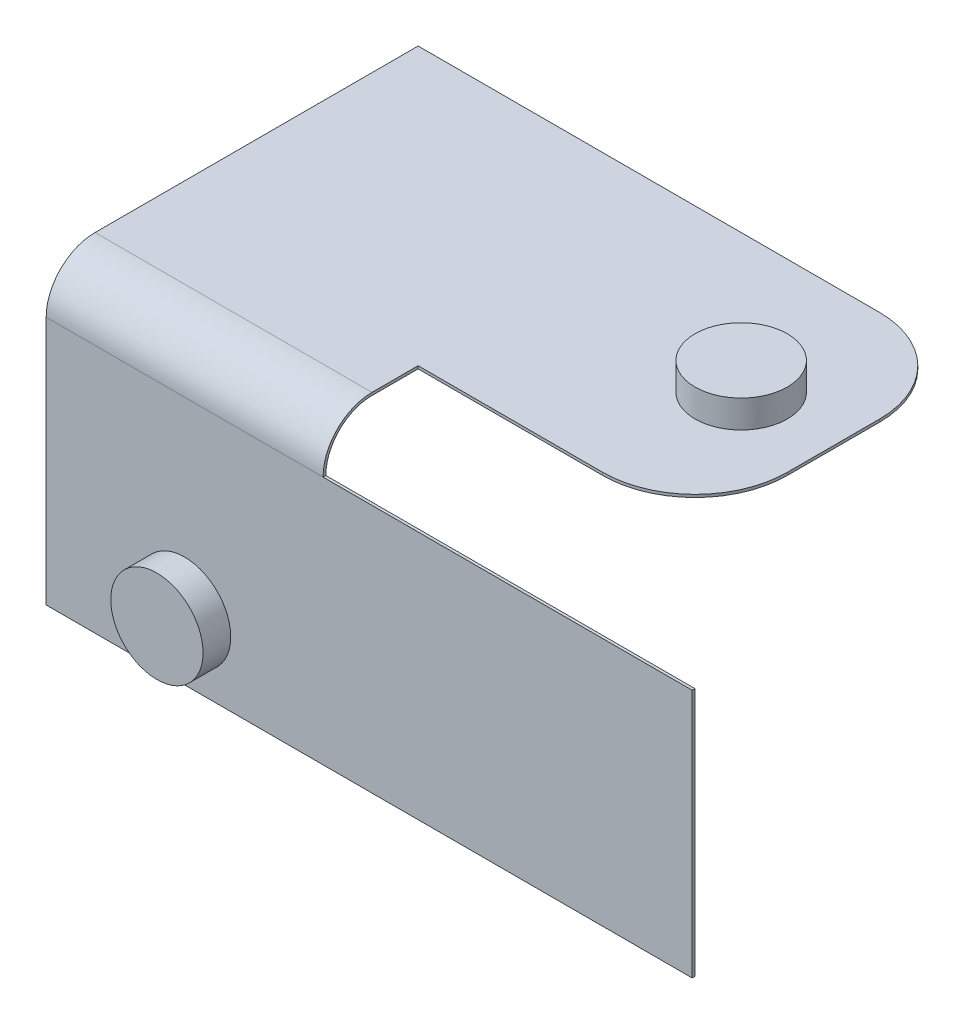
ISO-10303-21;
HEADER;
FILE_DESCRIPTION(('STEP AP214'),'2;1');
FILE_NAME('part.step','',(''),(''),'','','');
FILE_SCHEMA(('AUTOMOTIVE_DESIGN { 1 0 10303 214 1 1 1 1 }'));
ENDSEC;
DATA;
#1=APPLICATION_CONTEXT('core data for automotive mechanical design processes');
#2=APPLICATION_PROTOCOL_DEFINITION('international standard','automotive_design',2000,#1);
#3=PRODUCT_CONTEXT('',#1,'mechanical');
#4=PRODUCT('Part','Part','',(#3));
#5=PRODUCT_RELATED_PRODUCT_CATEGORY('part','',(#4));
#6=PRODUCT_DEFINITION_FORMATION('','',#4);
#7=PRODUCT_DEFINITION_CONTEXT('part definition',#1,'design');
#8=PRODUCT_DEFINITION('design','',#6,#7);
#9=PRODUCT_DEFINITION_SHAPE('','',#8);
#10=(LENGTH_UNIT() NAMED_UNIT(*) SI_UNIT(.MILLI.,.METRE.));
#11=(NAMED_UNIT(*) PLANE_ANGLE_UNIT() SI_UNIT($,.RADIAN.));
#12=(NAMED_UNIT(*) SI_UNIT($,.STERADIAN.) SOLID_ANGLE_UNIT());
#13=UNCERTAINTY_MEASURE_WITH_UNIT(LENGTH_MEASURE(1.E-05),#10,'distance_accuracy_value','');
#14=(GEOMETRIC_REPRESENTATION_CONTEXT(3) GLOBAL_UNCERTAINTY_ASSIGNED_CONTEXT((#13)) GLOBAL_UNIT_ASSIGNED_CONTEXT((#10,
#11,#12)) REPRESENTATION_CONTEXT('',''));
#15=CARTESIAN_POINT('',(0.,0.,0.));
#16=DIRECTION('',(0.,0.,1.));
#17=DIRECTION('',(1.,0.,0.));
#18=AXIS2_PLACEMENT_3D('',#15,#16,#17);
#19=CARTESIAN_POINT('',(-33.6063315408995,-5.,33.8452585970276));
#20=DIRECTION('',(1.,0.,0.));
#21=DIRECTION('',(0.,0.,-1.));
#22=AXIS2_PLACEMENT_3D('',#19,#20,#21);
#23=PLANE('',#22);
#24=CARTESIAN_POINT('',(-33.6063315408995,-5.,33.8452585970276));
#25=DIRECTION('',(-1.,0.,0.));
#26=DIRECTION('',(0.,0.,-1.));
#27=AXIS2_PLACEMENT_3D('',#24,#25,#26);
#28=CIRCLE('',#27,5.3);
#29=CARTESIAN_POINT('',(-33.6063315408995,-4.99999999999995,39.1452585970276));
#30=VERTEX_POINT('',#29);
#31=CARTESIAN_POINT('',(-33.6063315408995,0.3,33.8452585970276));
#32=VERTEX_POINT('',#31);
#33=EDGE_CURVE('E187',#30,#32,#28,.T.);
#34=ORIENTED_EDGE('',*,*,#33,.F.);
#35=DIRECTION('',(0.,0.,1.));
#36=VECTOR('',#35,1.);
#37=CARTESIAN_POINT('',(-33.6063315408995,-4.99999999999995,39.1452585970276));
#38=LINE('',#37,#36);
#39=CARTESIAN_POINT('',(-33.6063315408995,-4.99999999999994,38.8452585970276));
#40=VERTEX_POINT('',#39);
#41=EDGE_CURVE('E157',#40,#30,#38,.T.);
#42=ORIENTED_EDGE('',*,*,#41,.F.);
#43=CARTESIAN_POINT('',(-33.6063315408995,-5.,33.8452585970276));
#44=DIRECTION('',(1.,0.,0.));
#45=DIRECTION('',(0.,0.,-1.));
#46=AXIS2_PLACEMENT_3D('',#43,#44,#45);
#47=CIRCLE('',#46,5.);
#48=CARTESIAN_POINT('',(-33.6063315408995,0.,33.8452585970276));
#49=VERTEX_POINT('',#48);
#50=EDGE_CURVE('E184',#49,#40,#47,.T.);
#51=ORIENTED_EDGE('',*,*,#50,.F.);
#52=DIRECTION('',(0.,0.,1.));
#53=VECTOR('',#52,1.);
#54=CARTESIAN_POINT('',(-33.6063315408995,0.,28.8452585970276));
#55=LINE('',#54,#53);
#56=CARTESIAN_POINT('',(-33.6063315408995,0.,28.8452585970276));
#57=VERTEX_POINT('',#56);
#58=EDGE_CURVE('E180',#57,#49,#55,.T.);
#59=ORIENTED_EDGE('',*,*,#58,.F.);
#60=DIRECTION('',(0.,-1.,0.));
#61=VECTOR('',#60,1.);
#62=CARTESIAN_POINT('',(-33.6063315408995,0.,28.8452585970276));
#63=LINE('',#62,#61);
#64=CARTESIAN_POINT('',(-33.6063315408995,0.3,28.8452585970276));
#65=VERTEX_POINT('',#64);
#66=EDGE_CURVE('E177',#65,#57,#63,.T.);
#67=ORIENTED_EDGE('',*,*,#66,.F.);
#68=DIRECTION('',(0.,0.,-1.));
#69=VECTOR('',#68,1.);
#70=CARTESIAN_POINT('',(-33.6063315408995,0.3,28.8452585970276));
#71=LINE('',#70,#69);
#72=EDGE_CURVE('E190',#32,#65,#71,.T.);
#73=ORIENTED_EDGE('',*,*,#72,.F.);
#74=EDGE_LOOP('',(#34,#42,#51,#59,#67,#73));
#75=FACE_BOUND('',#74,.T.);
#76=ADVANCED_FACE('F35',(#75),#23,.T.);
#77=CARTESIAN_POINT('',(-3.60633154089946,0.3,-1.15474140297239));
#78=DIRECTION('',(-1.,0.,0.));
#79=DIRECTION('',(0.,0.,1.));
#80=AXIS2_PLACEMENT_3D('',#77,#78,#79);
#81=PLANE('',#80);
#82=DIRECTION('',(0.,0.,-1.));
#83=VECTOR('',#82,1.);
#84=CARTESIAN_POINT('',(-3.60633154089946,0.,-1.15474140297239));
#85=LINE('',#84,#83);
#86=CARTESIAN_POINT('',(-3.60633154089946,0.,18.8452585970276));
#87=VERTEX_POINT('',#86);
#88=CARTESIAN_POINT('',(-3.60633154089946,0.,8.84525859702761));
#89=VERTEX_POINT('',#88);
#90=EDGE_CURVE('E207',#87,#89,#85,.T.);
#91=ORIENTED_EDGE('',*,*,#90,.T.);
#92=DIRECTION('',(0.,-1.,0.));
#93=VECTOR('',#92,1.);
#94=CARTESIAN_POINT('',(-3.60633154089946,0.3,8.84525859702761));
#95=LINE('',#94,#93);
#96=CARTESIAN_POINT('',(-3.60633154089946,0.3,8.84525859702761));
#97=VERTEX_POINT('',#96);
#98=EDGE_CURVE('E56',#89,#97,#95,.F.);
#99=ORIENTED_EDGE('',*,*,#98,.T.);
#100=DIRECTION('',(0.,0.,-1.));
#101=VECTOR('',#100,1.);
#102=CARTESIAN_POINT('',(-3.60633154089946,0.3,-1.15474140297239));
#103=LINE('',#102,#101);
#104=CARTESIAN_POINT('',(-3.60633154089946,0.3,18.8452585970276));
#105=VERTEX_POINT('',#104);
#106=EDGE_CURVE('E214',#105,#97,#103,.T.);
#107=ORIENTED_EDGE('',*,*,#106,.F.);
#108=DIRECTION('',(0.,-1.,0.));
#109=VECTOR('',#108,1.);
#110=CARTESIAN_POINT('',(-3.60633154089946,0.3,18.8452585970276));
#111=LINE('',#110,#109);
#112=EDGE_CURVE('E242',#105,#87,#111,.T.);
#113=ORIENTED_EDGE('',*,*,#112,.T.);
#114=EDGE_LOOP('',(#91,#99,#107,#113));
#115=FACE_BOUND('',#114,.T.);
#116=ADVANCED_FACE('F263',(#115),#81,.F.);
#117=CARTESIAN_POINT('',(-3.60633154089946,0.3,-1.15474140297239));
#118=DIRECTION('',(0.,0.,1.));
#119=DIRECTION('',(1.,0.,0.));
#120=AXIS2_PLACEMENT_3D('',#117,#118,#119);
#121=PLANE('',#120);
#122=DIRECTION('',(-1.,0.,0.));
#123=VECTOR('',#122,1.);
#124=CARTESIAN_POINT('',(-3.60633154089946,0.3,-1.15474140297239));
#125=LINE('',#124,#123);
#126=CARTESIAN_POINT('',(-13.6063315408995,0.3,-1.15474140297239));
#127=VERTEX_POINT('',#126);
#128=CARTESIAN_POINT('',(-63.6063315408995,0.3,-1.15474140297238));
#129=VERTEX_POINT('',#128);
#130=EDGE_CURVE('E216',#127,#129,#125,.T.);
#131=ORIENTED_EDGE('',*,*,#130,.F.);
#132=DIRECTION('',(0.,-1.,0.));
#133=VECTOR('',#132,1.);
#134=CARTESIAN_POINT('',(-13.6063315408995,0.3,-1.15474140297239));
#135=LINE('',#134,#133);
#136=CARTESIAN_POINT('',(-13.6063315408995,0.,-1.15474140297239));
#137=VERTEX_POINT('',#136);
#138=EDGE_CURVE('E235',#127,#137,#135,.T.);
#139=ORIENTED_EDGE('',*,*,#138,.T.);
#140=DIRECTION('',(-1.,0.,0.));
#141=VECTOR('',#140,1.);
#142=CARTESIAN_POINT('',(-3.60633154089946,0.,-1.15474140297239));
#143=LINE('',#142,#141);
#144=CARTESIAN_POINT('',(-63.6063315408995,0.,-1.15474140297238));
#145=VERTEX_POINT('',#144);
#146=EDGE_CURVE('E225',#137,#145,#143,.T.);
#147=ORIENTED_EDGE('',*,*,#146,.T.);
#148=DIRECTION('',(0.,-1.,0.));
#149=VECTOR('',#148,1.);
#150=CARTESIAN_POINT('',(-63.6063315408995,0.3,-1.15474140297238));
#151=LINE('',#150,#149);
#152=EDGE_CURVE('E223',#129,#145,#151,.T.);
#153=ORIENTED_EDGE('',*,*,#152,.F.);
#154=EDGE_LOOP('',(#131,#139,#147,#153));
#155=FACE_BOUND('',#154,.T.);
#156=ADVANCED_FACE('F255',(#155),#121,.F.);
#157=CARTESIAN_POINT('',(-63.6063315408995,0.3,-1.15474140297238));
#158=DIRECTION('',(1.,0.,0.));
#159=DIRECTION('',(0.,0.,-1.));
#160=AXIS2_PLACEMENT_3D('',#157,#158,#159);
#161=PLANE('',#160);
#162=DIRECTION('',(0.,0.,1.));
#163=VECTOR('',#162,1.);
#164=CARTESIAN_POINT('',(-63.6063315408995,0.,-1.15474140297238));
#165=LINE('',#164,#163);
#166=CARTESIAN_POINT('',(-63.6063315408995,0.,33.8452585970276));
#167=VERTEX_POINT('',#166);
#168=EDGE_CURVE('E227',#145,#167,#165,.T.);
#169=ORIENTED_EDGE('',*,*,#168,.T.);
#170=CARTESIAN_POINT('',(-63.6063315408995,-5.,33.8452585970276));
#171=DIRECTION('',(1.,0.,0.));
#172=DIRECTION('',(0.,0.,-1.));
#173=AXIS2_PLACEMENT_3D('',#170,#171,#172);
#174=CIRCLE('',#173,5.);
#175=CARTESIAN_POINT('',(-63.6063315408995,-4.99999999999994,38.8452585970276));
#176=VERTEX_POINT('',#175);
#177=EDGE_CURVE('E174',#167,#176,#174,.T.);
#178=ORIENTED_EDGE('',*,*,#177,.T.);
#179=DIRECTION('',(0.,-1.,0.));
#180=VECTOR('',#179,1.);
#181=CARTESIAN_POINT('',(-63.6063315408995,-31.9999999999999,38.8452585970276));
#182=LINE('',#181,#180);
#183=CARTESIAN_POINT('',(-63.6063315408995,-31.9999999999999,38.8452585970276));
#184=VERTEX_POINT('',#183);
#185=EDGE_CURVE('E196',#176,#184,#182,.T.);
#186=ORIENTED_EDGE('',*,*,#185,.T.);
#187=DIRECTION('',(0.,0.,1.));
#188=VECTOR('',#187,1.);
#189=CARTESIAN_POINT('',(-63.6063315408995,-31.9999999999999,39.1452585970276));
#190=LINE('',#189,#188);
#191=CARTESIAN_POINT('',(-63.6063315408995,-31.9999999999999,39.1452585970276));
#192=VERTEX_POINT('',#191);
#193=EDGE_CURVE('E199',#184,#192,#190,.T.);
#194=ORIENTED_EDGE('',*,*,#193,.T.);
#195=DIRECTION('',(0.,1.,0.));
#196=VECTOR('',#195,1.);
#197=CARTESIAN_POINT('',(-63.6063315408995,-4.99999999999995,39.1452585970276));
#198=LINE('',#197,#196);
#199=CARTESIAN_POINT('',(-63.6063315408995,-4.99999999999995,39.1452585970276));
#200=VERTEX_POINT('',#199);
#201=EDGE_CURVE('E139',#192,#200,#198,.T.);
#202=ORIENTED_EDGE('',*,*,#201,.T.);
#203=CARTESIAN_POINT('',(-63.6063315408995,-5.,33.8452585970276));
#204=DIRECTION('',(-1.,0.,0.));
#205=DIRECTION('',(0.,0.,-1.));
#206=AXIS2_PLACEMENT_3D('',#203,#204,#205);
#207=CIRCLE('',#206,5.3);
#208=CARTESIAN_POINT('',(-63.6063315408995,0.3,33.8452585970276));
#209=VERTEX_POINT('',#208);
#210=EDGE_CURVE('E181',#200,#209,#207,.T.);
#211=ORIENTED_EDGE('',*,*,#210,.T.);
#212=DIRECTION('',(0.,0.,1.));
#213=VECTOR('',#212,1.);
#214=CARTESIAN_POINT('',(-63.6063315408995,0.3,-1.15474140297238));
#215=LINE('',#214,#213);
#216=EDGE_CURVE('E219',#129,#209,#215,.T.);
#217=ORIENTED_EDGE('',*,*,#216,.F.);
#218=ORIENTED_EDGE('',*,*,#152,.T.);
#219=EDGE_LOOP('',(#169,#178,#186,#194,#202,#211,#217,#218));
#220=FACE_BOUND('',#219,.T.);
#221=ADVANCED_FACE('F288',(#220),#161,.F.);
#222=CARTESIAN_POINT('',(-3.60633154089945,0.3,28.8452585970276));
#223=DIRECTION('',(0.,0.,-1.));
#224=DIRECTION('',(-1.,0.,0.));
#225=AXIS2_PLACEMENT_3D('',#222,#223,#224);
#226=PLANE('',#225);
#227=DIRECTION('',(1.,0.,0.));
#228=VECTOR('',#227,1.);
#229=CARTESIAN_POINT('',(-3.60633154089945,0.,28.8452585970276));
#230=LINE('',#229,#228);
#231=CARTESIAN_POINT('',(-13.6063315408995,0.,28.8452585970276));
#232=VERTEX_POINT('',#231);
#233=EDGE_CURVE('E217',#57,#232,#230,.T.);
#234=ORIENTED_EDGE('',*,*,#233,.T.);
#235=DIRECTION('',(0.,-1.,0.));
#236=VECTOR('',#235,1.);
#237=CARTESIAN_POINT('',(-13.6063315408995,0.3,28.8452585970276));
#238=LINE('',#237,#236);
#239=CARTESIAN_POINT('',(-13.6063315408995,0.3,28.8452585970276));
#240=VERTEX_POINT('',#239);
#241=EDGE_CURVE('E11',#232,#240,#238,.F.);
#242=ORIENTED_EDGE('',*,*,#241,.T.);
#243=DIRECTION('',(1.,0.,0.));
#244=VECTOR('',#243,1.);
#245=CARTESIAN_POINT('',(-3.60633154089945,0.3,28.8452585970276));
#246=LINE('',#245,#244);
#247=EDGE_CURVE('E221',#65,#240,#246,.T.);
#248=ORIENTED_EDGE('',*,*,#247,.F.);
#249=ORIENTED_EDGE('',*,*,#66,.T.);
#250=EDGE_LOOP('',(#234,#242,#248,#249));
#251=FACE_BOUND('',#250,.T.);
#252=ADVANCED_FACE('F268',(#251),#226,.F.);
#253=CARTESIAN_POINT('',(0.,0.3,0.));
#254=DIRECTION('',(0.,-1.,0.));
#255=DIRECTION('',(0.,0.,-1.));
#256=AXIS2_PLACEMENT_3D('',#253,#254,#255);
#257=PLANE('',#256);
#258=CARTESIAN_POINT('',(-13.6063315408994,0.3,13.8452585970276));
#259=DIRECTION('',(0.,-1.,0.));
#260=DIRECTION('',(0.,0.,-1.));
#261=AXIS2_PLACEMENT_3D('',#258,#259,#260);
#262=CIRCLE('',#261,5.);
#263=CARTESIAN_POINT('',(-13.6063315408994,0.3,8.84525859702761));
#264=VERTEX_POINT('',#263);
#265=EDGE_CURVE('E232',#264,#264,#262,.F.);
#266=ORIENTED_EDGE('',*,*,#265,.F.);
#267=EDGE_LOOP('',(#266));
#268=FACE_BOUND('',#267,.T.);
#269=ORIENTED_EDGE('',*,*,#106,.T.);
#270=CARTESIAN_POINT('',(-13.6063315408995,0.3,8.84525859702761));
#271=DIRECTION('',(0.,-1.,0.));
#272=DIRECTION('',(0.,0.,-1.));
#273=AXIS2_PLACEMENT_3D('',#270,#271,#272);
#274=CIRCLE('',#273,10.);
#275=EDGE_CURVE('E43',#97,#127,#274,.F.);
#276=ORIENTED_EDGE('',*,*,#275,.T.);
#277=ORIENTED_EDGE('',*,*,#130,.T.);
#278=ORIENTED_EDGE('',*,*,#216,.T.);
#279=DIRECTION('',(-1.,0.,0.));
#280=VECTOR('',#279,1.);
#281=CARTESIAN_POINT('',(-33.6063315408995,0.3,33.8452585970276));
#282=LINE('',#281,#280);
#283=EDGE_CURVE('E204',#32,#209,#282,.T.);
#284=ORIENTED_EDGE('',*,*,#283,.F.);
#285=ORIENTED_EDGE('',*,*,#72,.T.);
#286=ORIENTED_EDGE('',*,*,#247,.T.);
#287=CARTESIAN_POINT('',(-13.6063315408995,0.3,18.8452585970276));
#288=DIRECTION('',(0.,-1.,0.));
#289=DIRECTION('',(0.,0.,-1.));
#290=AXIS2_PLACEMENT_3D('',#287,#288,#289);
#291=CIRCLE('',#290,10.);
#292=EDGE_CURVE('E246',#240,#105,#291,.F.);
#293=ORIENTED_EDGE('',*,*,#292,.T.);
#294=EDGE_LOOP('',(#269,#276,#277,#278,#284,#285,#286,#293));
#295=FACE_BOUND('',#294,.T.);
#296=ADVANCED_FACE('F250',(#268,#295),#257,.F.);
#297=CARTESIAN_POINT('',(0.,0.,0.));
#298=DIRECTION('',(0.,-1.,0.));
#299=DIRECTION('',(0.,0.,-1.));
#300=AXIS2_PLACEMENT_3D('',#297,#298,#299);
#301=PLANE('',#300);
#302=ORIENTED_EDGE('',*,*,#146,.F.);
#303=CARTESIAN_POINT('',(-13.6063315408995,0.,8.84525859702761));
#304=DIRECTION('',(0.,-1.,0.));
#305=DIRECTION('',(0.,0.,-1.));
#306=AXIS2_PLACEMENT_3D('',#303,#304,#305);
#307=CIRCLE('',#306,10.);
#308=EDGE_CURVE('E240',#137,#89,#307,.T.);
#309=ORIENTED_EDGE('',*,*,#308,.T.);
#310=ORIENTED_EDGE('',*,*,#90,.F.);
#311=CARTESIAN_POINT('',(-13.6063315408995,0.,18.8452585970276));
#312=DIRECTION('',(0.,-1.,0.));
#313=DIRECTION('',(0.,0.,-1.));
#314=AXIS2_PLACEMENT_3D('',#311,#312,#313);
#315=CIRCLE('',#314,10.);
#316=EDGE_CURVE('E238',#87,#232,#315,.T.);
#317=ORIENTED_EDGE('',*,*,#316,.T.);
#318=ORIENTED_EDGE('',*,*,#233,.F.);
#319=ORIENTED_EDGE('',*,*,#58,.T.);
#320=DIRECTION('',(-1.,0.,0.));
#321=VECTOR('',#320,1.);
#322=CARTESIAN_POINT('',(-33.6063315408995,0.,33.8452585970276));
#323=LINE('',#322,#321);
#324=EDGE_CURVE('E193',#49,#167,#323,.T.);
#325=ORIENTED_EDGE('',*,*,#324,.T.);
#326=ORIENTED_EDGE('',*,*,#168,.F.);
#327=EDGE_LOOP('',(#302,#309,#310,#317,#318,#319,#325,#326));
#328=FACE_BOUND('',#327,.T.);
#329=ADVANCED_FACE('F261',(#328),#301,.T.);
#330=CARTESIAN_POINT('',(-33.6063315408995,-5.,33.8452585970276));
#331=DIRECTION('',(-1.,0.,0.));
#332=DIRECTION('',(0.,0.,1.));
#333=AXIS2_PLACEMENT_3D('',#330,#331,#332);
#334=CYLINDRICAL_SURFACE('',#333,5.3);
#335=ORIENTED_EDGE('',*,*,#210,.F.);
#336=DIRECTION('',(-1.,0.,0.));
#337=VECTOR('',#336,1.);
#338=CARTESIAN_POINT('',(-33.6063315408995,-4.99999999999995,39.1452585970276));
#339=LINE('',#338,#337);
#340=EDGE_CURVE('E143',#30,#200,#339,.T.);
#341=ORIENTED_EDGE('',*,*,#340,.F.);
#342=ORIENTED_EDGE('',*,*,#33,.T.);
#343=ORIENTED_EDGE('',*,*,#283,.T.);
#344=EDGE_LOOP('',(#335,#341,#342,#343));
#345=FACE_BOUND('',#344,.T.);
#346=ADVANCED_FACE('F276',(#345),#334,.T.);
#347=CARTESIAN_POINT('',(-33.6063315408995,-4.99999999999995,39.1452585970276));
#348=DIRECTION('',(0.,0.,1.));
#349=DIRECTION('',(1.,0.,0.));
#350=AXIS2_PLACEMENT_3D('',#347,#348,#349);
#351=PLANE('',#350);
#352=CARTESIAN_POINT('',(-48.6063315408995,-24.9999999999999,39.1452585970276));
#353=DIRECTION('',(0.,0.,1.));
#354=DIRECTION('',(1.,0.,0.));
#355=AXIS2_PLACEMENT_3D('',#352,#353,#354);
#356=CIRCLE('',#355,5.);
#357=CARTESIAN_POINT('',(-43.6063315408994,-24.9999999999999,39.1452585970276));
#358=VERTEX_POINT('',#357);
#359=EDGE_CURVE('E170',#358,#358,#356,.T.);
#360=ORIENTED_EDGE('',*,*,#359,.F.);
#361=EDGE_LOOP('',(#360));
#362=FACE_BOUND('',#361,.T.);
#363=ORIENTED_EDGE('',*,*,#201,.F.);
#364=DIRECTION('',(-1.,0.,0.));
#365=VECTOR('',#364,1.);
#366=CARTESIAN_POINT('',(-33.6063315408995,-31.9999999999999,39.1452585970276));
#367=LINE('',#366,#365);
#368=CARTESIAN_POINT('',(6.39366845910057,-31.9999999999999,39.1452585970276));
#369=VERTEX_POINT('',#368);
#370=EDGE_CURVE('E132',#369,#192,#367,.T.);
#371=ORIENTED_EDGE('',*,*,#370,.F.);
#372=DIRECTION('',(0.,-1.,0.));
#373=VECTOR('',#372,1.);
#374=CARTESIAN_POINT('',(6.39366845910057,-4.99999999999995,39.1452585970276));
#375=LINE('',#374,#373);
#376=CARTESIAN_POINT('',(6.39366845910057,-4.99999999999995,39.1452585970276));
#377=VERTEX_POINT('',#376);
#378=EDGE_CURVE('E137',#377,#369,#375,.T.);
#379=ORIENTED_EDGE('',*,*,#378,.F.);
#380=DIRECTION('',(-1.,0.,0.));
#381=VECTOR('',#380,1.);
#382=CARTESIAN_POINT('',(6.39366845910057,-4.99999999999995,39.1452585970276));
#383=LINE('',#382,#381);
#384=EDGE_CURVE('E162',#377,#30,#383,.T.);
#385=ORIENTED_EDGE('',*,*,#384,.T.);
#386=ORIENTED_EDGE('',*,*,#340,.T.);
#387=EDGE_LOOP('',(#363,#371,#379,#385,#386));
#388=FACE_BOUND('',#387,.T.);
#389=ADVANCED_FACE('F134',(#362,#388),#351,.T.);
#390=CARTESIAN_POINT('',(-33.6063315408995,-31.9999999999999,39.1452585970276));
#391=DIRECTION('',(0.,-1.,0.));
#392=DIRECTION('',(0.,0.,-1.));
#393=AXIS2_PLACEMENT_3D('',#390,#391,#392);
#394=PLANE('',#393);
#395=ORIENTED_EDGE('',*,*,#193,.F.);
#396=DIRECTION('',(-1.,0.,0.));
#397=VECTOR('',#396,1.);
#398=CARTESIAN_POINT('',(-33.6063315408995,-31.9999999999999,38.8452585970276));
#399=LINE('',#398,#397);
#400=CARTESIAN_POINT('',(6.39366845910057,-31.9999999999999,38.8452585970276));
#401=VERTEX_POINT('',#400);
#402=EDGE_CURVE('E144',#401,#184,#399,.T.);
#403=ORIENTED_EDGE('',*,*,#402,.F.);
#404=DIRECTION('',(0.,0.,-1.));
#405=VECTOR('',#404,1.);
#406=CARTESIAN_POINT('',(6.39366845910057,-31.9999999999999,39.1452585970276));
#407=LINE('',#406,#405);
#408=EDGE_CURVE('E147',#369,#401,#407,.T.);
#409=ORIENTED_EDGE('',*,*,#408,.F.);
#410=ORIENTED_EDGE('',*,*,#370,.T.);
#411=EDGE_LOOP('',(#395,#403,#409,#410));
#412=FACE_BOUND('',#411,.T.);
#413=ADVANCED_FACE('F148',(#412),#394,.T.);
#414=CARTESIAN_POINT('',(-33.6063315408995,-31.9999999999999,38.8452585970276));
#415=DIRECTION('',(0.,0.,-1.));
#416=DIRECTION('',(0.,1.,0.));
#417=AXIS2_PLACEMENT_3D('',#414,#415,#416);
#418=PLANE('',#417);
#419=ORIENTED_EDGE('',*,*,#185,.F.);
#420=DIRECTION('',(-1.,0.,0.));
#421=VECTOR('',#420,1.);
#422=CARTESIAN_POINT('',(-33.6063315408995,-4.99999999999994,38.8452585970276));
#423=LINE('',#422,#421);
#424=EDGE_CURVE('E210',#40,#176,#423,.T.);
#425=ORIENTED_EDGE('',*,*,#424,.F.);
#426=DIRECTION('',(-1.,0.,0.));
#427=VECTOR('',#426,1.);
#428=CARTESIAN_POINT('',(6.39366845910057,-4.99999999999995,38.8452585970276));
#429=LINE('',#428,#427);
#430=CARTESIAN_POINT('',(6.39366845910057,-4.99999999999995,38.8452585970276));
#431=VERTEX_POINT('',#430);
#432=EDGE_CURVE('E165',#431,#40,#429,.T.);
#433=ORIENTED_EDGE('',*,*,#432,.F.);
#434=DIRECTION('',(0.,1.,0.));
#435=VECTOR('',#434,1.);
#436=CARTESIAN_POINT('',(6.39366845910057,-4.99999999999995,38.8452585970276));
#437=LINE('',#436,#435);
#438=EDGE_CURVE('E151',#401,#431,#437,.T.);
#439=ORIENTED_EDGE('',*,*,#438,.F.);
#440=ORIENTED_EDGE('',*,*,#402,.T.);
#441=EDGE_LOOP('',(#419,#425,#433,#439,#440));
#442=FACE_BOUND('',#441,.T.);
#443=ADVANCED_FACE('F283',(#442),#418,.T.);
#444=CARTESIAN_POINT('',(-33.6063315408995,-5.,33.8452585970276));
#445=DIRECTION('',(-1.,0.,0.));
#446=DIRECTION('',(0.,0.,1.));
#447=AXIS2_PLACEMENT_3D('',#444,#445,#446);
#448=CYLINDRICAL_SURFACE('',#447,5.);
#449=ORIENTED_EDGE('',*,*,#177,.F.);
#450=ORIENTED_EDGE('',*,*,#324,.F.);
#451=ORIENTED_EDGE('',*,*,#50,.T.);
#452=ORIENTED_EDGE('',*,*,#424,.T.);
#453=EDGE_LOOP('',(#449,#450,#451,#452));
#454=FACE_BOUND('',#453,.T.);
#455=ADVANCED_FACE('F286',(#454),#448,.F.);
#456=CARTESIAN_POINT('',(-48.6063315408995,-24.9999999999999,42.1452585970276));
#457=DIRECTION('',(0.,0.,-1.));
#458=DIRECTION('',(-1.,0.,0.));
#459=AXIS2_PLACEMENT_3D('',#456,#457,#458);
#460=CYLINDRICAL_SURFACE('',#459,5.);
#461=CARTESIAN_POINT('',(-48.6063315408995,-24.9999999999999,42.1452585970276));
#462=DIRECTION('',(0.,0.,1.));
#463=DIRECTION('',(1.,0.,0.));
#464=AXIS2_PLACEMENT_3D('',#461,#462,#463);
#465=CIRCLE('',#464,5.);
#466=CARTESIAN_POINT('',(-43.6063315408994,-24.9999999999999,42.1452585970276));
#467=VERTEX_POINT('',#466);
#468=EDGE_CURVE('E171',#467,#467,#465,.T.);
#469=ORIENTED_EDGE('',*,*,#468,.F.);
#470=EDGE_LOOP('',(#469));
#471=FACE_BOUND('',#470,.T.);
#472=ORIENTED_EDGE('',*,*,#359,.T.);
#473=EDGE_LOOP('',(#472));
#474=FACE_BOUND('',#473,.T.);
#475=ADVANCED_FACE('F305',(#471,#474),#460,.T.);
#476=CARTESIAN_POINT('',(-48.6063315408995,-24.9999999999999,42.1452585970276));
#477=DIRECTION('',(0.,0.,1.));
#478=DIRECTION('',(1.,0.,0.));
#479=AXIS2_PLACEMENT_3D('',#476,#477,#478);
#480=PLANE('',#479);
#481=ORIENTED_EDGE('',*,*,#468,.T.);
#482=EDGE_LOOP('',(#481));
#483=FACE_BOUND('',#482,.T.);
#484=ADVANCED_FACE('F354',(#483),#480,.T.);
#485=CARTESIAN_POINT('',(-13.6063315408994,3.3,13.8452585970276));
#486=DIRECTION('',(0.,-1.,0.));
#487=DIRECTION('',(0.,0.,-1.));
#488=AXIS2_PLACEMENT_3D('',#485,#486,#487);
#489=CYLINDRICAL_SURFACE('',#488,5.);
#490=CARTESIAN_POINT('',(-13.6063315408994,3.3,13.8452585970276));
#491=DIRECTION('',(0.,1.,0.));
#492=DIRECTION('',(0.,0.,1.));
#493=AXIS2_PLACEMENT_3D('',#490,#491,#492);
#494=CIRCLE('',#493,5.);
#495=CARTESIAN_POINT('',(-13.6063315408994,3.3,18.8452585970276));
#496=VERTEX_POINT('',#495);
#497=EDGE_CURVE('E167',#496,#496,#494,.T.);
#498=ORIENTED_EDGE('',*,*,#497,.F.);
#499=EDGE_LOOP('',(#498));
#500=FACE_BOUND('',#499,.T.);
#501=ORIENTED_EDGE('',*,*,#265,.T.);
#502=EDGE_LOOP('',(#501));
#503=FACE_BOUND('',#502,.T.);
#504=ADVANCED_FACE('F362',(#500,#503),#489,.T.);
#505=CARTESIAN_POINT('',(-13.6063315408994,3.3,13.8452585970276));
#506=DIRECTION('',(0.,1.,0.));
#507=DIRECTION('',(0.,0.,1.));
#508=AXIS2_PLACEMENT_3D('',#505,#506,#507);
#509=PLANE('',#508);
#510=ORIENTED_EDGE('',*,*,#497,.T.);
#511=EDGE_LOOP('',(#510));
#512=FACE_BOUND('',#511,.T.);
#513=ADVANCED_FACE('F369',(#512),#509,.T.);
#514=CARTESIAN_POINT('',(6.39366845910057,-4.99999999999995,39.1452585970276));
#515=DIRECTION('',(0.,-1.,0.));
#516=DIRECTION('',(0.,0.,-1.));
#517=AXIS2_PLACEMENT_3D('',#514,#515,#516);
#518=PLANE('',#517);
#519=ORIENTED_EDGE('',*,*,#41,.T.);
#520=ORIENTED_EDGE('',*,*,#384,.F.);
#521=DIRECTION('',(0.,0.,1.));
#522=VECTOR('',#521,1.);
#523=CARTESIAN_POINT('',(6.39366845910057,-4.99999999999995,39.1452585970276));
#524=LINE('',#523,#522);
#525=EDGE_CURVE('E155',#431,#377,#524,.T.);
#526=ORIENTED_EDGE('',*,*,#525,.F.);
#527=ORIENTED_EDGE('',*,*,#432,.T.);
#528=EDGE_LOOP('',(#519,#520,#526,#527));
#529=FACE_BOUND('',#528,.T.);
#530=ADVANCED_FACE('F376',(#529),#518,.F.);
#531=CARTESIAN_POINT('',(6.39366845910057,0.,0.));
#532=DIRECTION('',(1.,0.,0.));
#533=DIRECTION('',(0.,0.,-1.));
#534=AXIS2_PLACEMENT_3D('',#531,#532,#533);
#535=PLANE('',#534);
#536=ORIENTED_EDGE('',*,*,#378,.T.);
#537=ORIENTED_EDGE('',*,*,#408,.T.);
#538=ORIENTED_EDGE('',*,*,#438,.T.);
#539=ORIENTED_EDGE('',*,*,#525,.T.);
#540=EDGE_LOOP('',(#536,#537,#538,#539));
#541=FACE_BOUND('',#540,.T.);
#542=ADVANCED_FACE('F153',(#541),#535,.T.);
#543=CARTESIAN_POINT('',(-13.6063315408995,0.3,8.84525859702761));
#544=DIRECTION('',(0.,-1.,0.));
#545=DIRECTION('',(0.,0.,-1.));
#546=AXIS2_PLACEMENT_3D('',#543,#544,#545);
#547=CYLINDRICAL_SURFACE('',#546,10.);
#548=ORIENTED_EDGE('',*,*,#275,.F.);
#549=ORIENTED_EDGE('',*,*,#98,.F.);
#550=ORIENTED_EDGE('',*,*,#308,.F.);
#551=ORIENTED_EDGE('',*,*,#138,.F.);
#552=EDGE_LOOP('',(#548,#549,#550,#551));
#553=FACE_BOUND('',#552,.T.);
#554=ADVANCED_FACE('F258',(#553),#547,.T.);
#555=CARTESIAN_POINT('',(-13.6063315408995,0.3,18.8452585970276));
#556=DIRECTION('',(0.,-1.,0.));
#557=DIRECTION('',(0.,0.,-1.));
#558=AXIS2_PLACEMENT_3D('',#555,#556,#557);
#559=CYLINDRICAL_SURFACE('',#558,10.);
#560=ORIENTED_EDGE('',*,*,#292,.F.);
#561=ORIENTED_EDGE('',*,*,#241,.F.);
#562=ORIENTED_EDGE('',*,*,#316,.F.);
#563=ORIENTED_EDGE('',*,*,#112,.F.);
#564=EDGE_LOOP('',(#560,#561,#562,#563));
#565=FACE_BOUND('',#564,.T.);
#566=ADVANCED_FACE('F37',(#565),#559,.T.);
#567=CLOSED_SHELL('',(#76,#116,#156,#221,#252,#296,#329,#346,#389,#413,#443,#455,#475,#484,#504,
#513,#530,#542,#554,#566));
#568=MANIFOLD_SOLID_BREP('B2',#567);
#569=ADVANCED_BREP_SHAPE_REPRESENTATION('',(#18,#568),#14);
#570=SHAPE_DEFINITION_REPRESENTATION(#9,#569);
ENDSEC;
END-ISO-10303-21;
